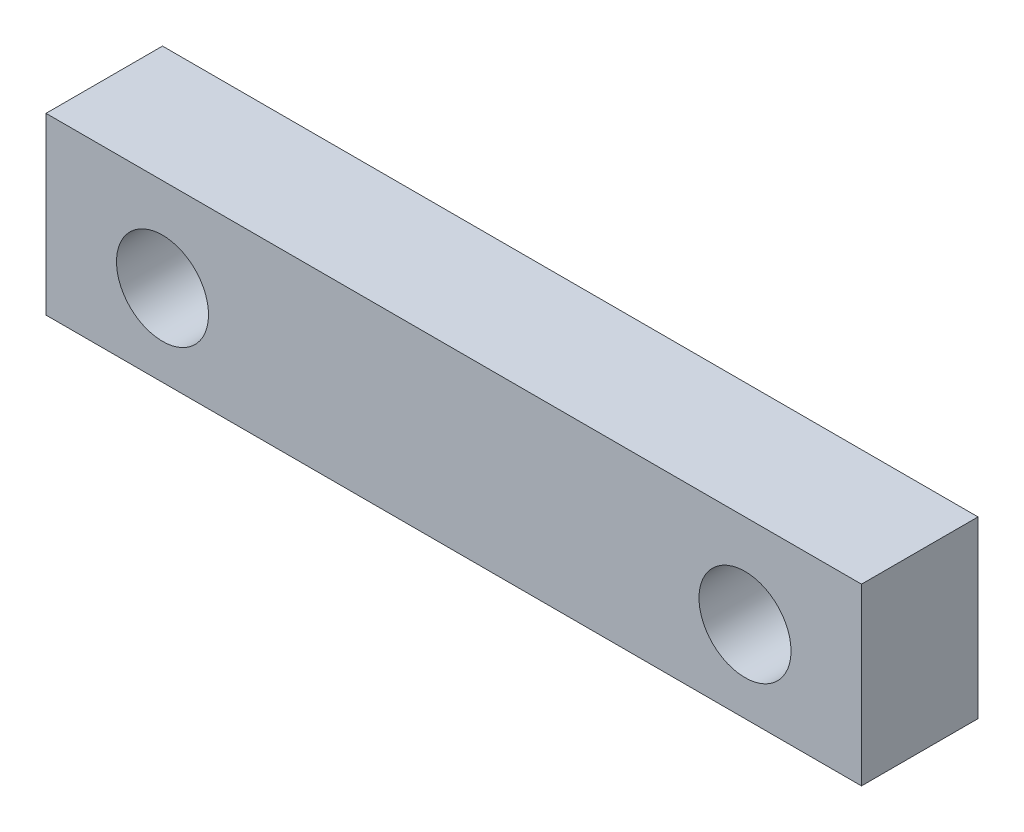
ISO-10303-21;
HEADER;
FILE_DESCRIPTION(('STEP AP214'),'2;1');
FILE_NAME('part.step','',(''),(''),'','','');
FILE_SCHEMA(('AUTOMOTIVE_DESIGN { 1 0 10303 214 1 1 1 1 }'));
ENDSEC;
DATA;
#1=APPLICATION_CONTEXT('core data for automotive mechanical design processes');
#2=APPLICATION_PROTOCOL_DEFINITION('international standard','automotive_design',2000,#1);
#3=PRODUCT_CONTEXT('',#1,'mechanical');
#4=PRODUCT('Part','Part','',(#3));
#5=PRODUCT_RELATED_PRODUCT_CATEGORY('part','',(#4));
#6=PRODUCT_DEFINITION_FORMATION('','',#4);
#7=PRODUCT_DEFINITION_CONTEXT('part definition',#1,'design');
#8=PRODUCT_DEFINITION('design','',#6,#7);
#9=PRODUCT_DEFINITION_SHAPE('','',#8);
#10=(LENGTH_UNIT() NAMED_UNIT(*) SI_UNIT(.MILLI.,.METRE.));
#11=(NAMED_UNIT(*) PLANE_ANGLE_UNIT() SI_UNIT($,.RADIAN.));
#12=(NAMED_UNIT(*) SI_UNIT($,.STERADIAN.) SOLID_ANGLE_UNIT());
#13=UNCERTAINTY_MEASURE_WITH_UNIT(LENGTH_MEASURE(1.E-05),#10,'distance_accuracy_value','');
#14=(GEOMETRIC_REPRESENTATION_CONTEXT(3) GLOBAL_UNCERTAINTY_ASSIGNED_CONTEXT((#13)) GLOBAL_UNIT_ASSIGNED_CONTEXT((#10,
#11,#12)) REPRESENTATION_CONTEXT('',''));
#15=CARTESIAN_POINT('',(0.,0.,0.));
#16=DIRECTION('',(0.,0.,1.));
#17=DIRECTION('',(1.,0.,0.));
#18=AXIS2_PLACEMENT_3D('',#15,#16,#17);
#19=CARTESIAN_POINT('',(0.,0.,6.35));
#20=DIRECTION('',(0.,0.,1.));
#21=DIRECTION('',(1.,0.,0.));
#22=AXIS2_PLACEMENT_3D('',#19,#20,#21);
#23=PLANE('',#22);
#24=CARTESIAN_POINT('',(-108.703833131341,52.9257336640657,6.35));
#25=DIRECTION('',(0.,0.,1.));
#26=DIRECTION('',(1.,0.,0.));
#27=AXIS2_PLACEMENT_3D('',#24,#25,#26);
#28=CIRCLE('',#27,2.50825000000001);
#29=CARTESIAN_POINT('',(-106.195583131341,52.9257336640657,6.35));
#30=VERTEX_POINT('',#29);
#31=EDGE_CURVE('E100',#30,#30,#28,.T.);
#32=ORIENTED_EDGE('',*,*,#31,.F.);
#33=EDGE_LOOP('',(#32));
#34=FACE_BOUND('',#33,.T.);
#35=DIRECTION('',(0.,-1.,0.));
#36=VECTOR('',#35,1.);
#37=CARTESIAN_POINT('',(-146.803833131341,58.0057336640657,6.35));
#38=LINE('',#37,#36);
#39=CARTESIAN_POINT('',(-146.803833131341,58.0057336640657,6.35));
#40=VERTEX_POINT('',#39);
#41=CARTESIAN_POINT('',(-146.803833131341,48.4807336640657,6.35));
#42=VERTEX_POINT('',#41);
#43=EDGE_CURVE('E85',#40,#42,#38,.T.);
#44=ORIENTED_EDGE('',*,*,#43,.T.);
#45=DIRECTION('',(1.,0.,0.));
#46=VECTOR('',#45,1.);
#47=CARTESIAN_POINT('',(-146.803833131341,48.4807336640657,6.35));
#48=LINE('',#47,#46);
#49=CARTESIAN_POINT('',(-102.353833131341,48.4807336640657,6.35));
#50=VERTEX_POINT('',#49);
#51=EDGE_CURVE('E80',#42,#50,#48,.T.);
#52=ORIENTED_EDGE('',*,*,#51,.T.);
#53=DIRECTION('',(0.,1.,0.));
#54=VECTOR('',#53,1.);
#55=CARTESIAN_POINT('',(-102.353833131341,48.4807336640657,6.35));
#56=LINE('',#55,#54);
#57=CARTESIAN_POINT('',(-102.353833131341,58.0057336640657,6.35));
#58=VERTEX_POINT('',#57);
#59=EDGE_CURVE('E83',#50,#58,#56,.T.);
#60=ORIENTED_EDGE('',*,*,#59,.T.);
#61=DIRECTION('',(-1.,0.,0.));
#62=VECTOR('',#61,1.);
#63=CARTESIAN_POINT('',(-102.353833131341,58.0057336640657,6.35));
#64=LINE('',#63,#62);
#65=EDGE_CURVE('E50',#58,#40,#64,.T.);
#66=ORIENTED_EDGE('',*,*,#65,.T.);
#67=EDGE_LOOP('',(#44,#52,#60,#66));
#68=FACE_BOUND('',#67,.T.);
#69=CARTESIAN_POINT('',(-140.453833131341,52.9257336640657,6.35));
#70=DIRECTION('',(0.,0.,1.));
#71=DIRECTION('',(1.,0.,0.));
#72=AXIS2_PLACEMENT_3D('',#69,#70,#71);
#73=CIRCLE('',#72,2.50824999999999);
#74=CARTESIAN_POINT('',(-137.945583131341,52.9257336640657,6.35));
#75=VERTEX_POINT('',#74);
#76=EDGE_CURVE('E115',#75,#75,#73,.T.);
#77=ORIENTED_EDGE('',*,*,#76,.F.);
#78=EDGE_LOOP('',(#77));
#79=FACE_BOUND('',#78,.T.);
#80=ADVANCED_FACE('F33',(#34,#68,#79),#23,.T.);
#81=CARTESIAN_POINT('',(0.,0.,0.));
#82=DIRECTION('',(0.,0.,1.));
#83=DIRECTION('',(1.,0.,0.));
#84=AXIS2_PLACEMENT_3D('',#81,#82,#83);
#85=PLANE('',#84);
#86=DIRECTION('',(0.,-1.,0.));
#87=VECTOR('',#86,1.);
#88=CARTESIAN_POINT('',(-146.803833131341,58.0057336640657,0.));
#89=LINE('',#88,#87);
#90=CARTESIAN_POINT('',(-146.803833131341,58.0057336640657,0.));
#91=VERTEX_POINT('',#90);
#92=CARTESIAN_POINT('',(-146.803833131341,48.4807336640657,0.));
#93=VERTEX_POINT('',#92);
#94=EDGE_CURVE('E97',#91,#93,#89,.T.);
#95=ORIENTED_EDGE('',*,*,#94,.F.);
#96=DIRECTION('',(-1.,0.,0.));
#97=VECTOR('',#96,1.);
#98=CARTESIAN_POINT('',(-102.353833131341,58.0057336640657,0.));
#99=LINE('',#98,#97);
#100=CARTESIAN_POINT('',(-102.353833131341,58.0057336640657,0.));
#101=VERTEX_POINT('',#100);
#102=EDGE_CURVE('E73',#101,#91,#99,.T.);
#103=ORIENTED_EDGE('',*,*,#102,.F.);
#104=DIRECTION('',(0.,1.,0.));
#105=VECTOR('',#104,1.);
#106=CARTESIAN_POINT('',(-102.353833131341,48.4807336640657,0.));
#107=LINE('',#106,#105);
#108=CARTESIAN_POINT('',(-102.353833131341,48.4807336640657,0.));
#109=VERTEX_POINT('',#108);
#110=EDGE_CURVE('E67',#109,#101,#107,.T.);
#111=ORIENTED_EDGE('',*,*,#110,.F.);
#112=DIRECTION('',(1.,0.,0.));
#113=VECTOR('',#112,1.);
#114=CARTESIAN_POINT('',(-146.803833131341,48.4807336640657,0.));
#115=LINE('',#114,#113);
#116=EDGE_CURVE('E89',#93,#109,#115,.T.);
#117=ORIENTED_EDGE('',*,*,#116,.F.);
#118=EDGE_LOOP('',(#95,#103,#111,#117));
#119=FACE_BOUND('',#118,.T.);
#120=CARTESIAN_POINT('',(-108.703833131341,52.9257336640657,0.));
#121=DIRECTION('',(0.,0.,1.));
#122=DIRECTION('',(1.,0.,0.));
#123=AXIS2_PLACEMENT_3D('',#120,#121,#122);
#124=CIRCLE('',#123,2.50825000000001);
#125=CARTESIAN_POINT('',(-106.195583131341,52.9257336640657,0.));
#126=VERTEX_POINT('',#125);
#127=EDGE_CURVE('E112',#126,#126,#124,.T.);
#128=ORIENTED_EDGE('',*,*,#127,.T.);
#129=EDGE_LOOP('',(#128));
#130=FACE_BOUND('',#129,.T.);
#131=CARTESIAN_POINT('',(-140.453833131341,52.9257336640657,0.));
#132=DIRECTION('',(0.,0.,1.));
#133=DIRECTION('',(1.,0.,0.));
#134=AXIS2_PLACEMENT_3D('',#131,#132,#133);
#135=CIRCLE('',#134,2.50824999999999);
#136=CARTESIAN_POINT('',(-137.945583131341,52.9257336640657,0.));
#137=VERTEX_POINT('',#136);
#138=EDGE_CURVE('E118',#137,#137,#135,.T.);
#139=ORIENTED_EDGE('',*,*,#138,.T.);
#140=EDGE_LOOP('',(#139));
#141=FACE_BOUND('',#140,.T.);
#142=ADVANCED_FACE('F108',(#119,#130,#141),#85,.F.);
#143=CARTESIAN_POINT('',(-146.803833131341,58.0057336640657,6.35));
#144=DIRECTION('',(1.,0.,0.));
#145=DIRECTION('',(0.,0.,-1.));
#146=AXIS2_PLACEMENT_3D('',#143,#144,#145);
#147=PLANE('',#146);
#148=ORIENTED_EDGE('',*,*,#94,.T.);
#149=DIRECTION('',(0.,0.,-1.));
#150=VECTOR('',#149,1.);
#151=CARTESIAN_POINT('',(-146.803833131341,48.4807336640657,6.35));
#152=LINE('',#151,#150);
#153=EDGE_CURVE('E11',#42,#93,#152,.T.);
#154=ORIENTED_EDGE('',*,*,#153,.F.);
#155=ORIENTED_EDGE('',*,*,#43,.F.);
#156=DIRECTION('',(0.,0.,-1.));
#157=VECTOR('',#156,1.);
#158=CARTESIAN_POINT('',(-146.803833131341,58.0057336640657,6.35));
#159=LINE('',#158,#157);
#160=EDGE_CURVE('E93',#40,#91,#159,.T.);
#161=ORIENTED_EDGE('',*,*,#160,.T.);
#162=EDGE_LOOP('',(#148,#154,#155,#161));
#163=FACE_BOUND('',#162,.T.);
#164=ADVANCED_FACE('F35',(#163),#147,.F.);
#165=CARTESIAN_POINT('',(-146.803833131341,48.4807336640657,6.35));
#166=DIRECTION('',(0.,1.,0.));
#167=DIRECTION('',(0.,0.,1.));
#168=AXIS2_PLACEMENT_3D('',#165,#166,#167);
#169=PLANE('',#168);
#170=ORIENTED_EDGE('',*,*,#116,.T.);
#171=DIRECTION('',(0.,0.,-1.));
#172=VECTOR('',#171,1.);
#173=CARTESIAN_POINT('',(-102.353833131341,48.4807336640657,6.35));
#174=LINE('',#173,#172);
#175=EDGE_CURVE('E42',#50,#109,#174,.T.);
#176=ORIENTED_EDGE('',*,*,#175,.F.);
#177=ORIENTED_EDGE('',*,*,#51,.F.);
#178=ORIENTED_EDGE('',*,*,#153,.T.);
#179=EDGE_LOOP('',(#170,#176,#177,#178));
#180=FACE_BOUND('',#179,.T.);
#181=ADVANCED_FACE('F88',(#180),#169,.F.);
#182=CARTESIAN_POINT('',(-102.353833131341,48.4807336640657,6.35));
#183=DIRECTION('',(-1.,0.,0.));
#184=DIRECTION('',(0.,0.,1.));
#185=AXIS2_PLACEMENT_3D('',#182,#183,#184);
#186=PLANE('',#185);
#187=ORIENTED_EDGE('',*,*,#110,.T.);
#188=DIRECTION('',(0.,0.,-1.));
#189=VECTOR('',#188,1.);
#190=CARTESIAN_POINT('',(-102.353833131341,58.0057336640657,6.35));
#191=LINE('',#190,#189);
#192=EDGE_CURVE('E90',#58,#101,#191,.T.);
#193=ORIENTED_EDGE('',*,*,#192,.F.);
#194=ORIENTED_EDGE('',*,*,#59,.F.);
#195=ORIENTED_EDGE('',*,*,#175,.T.);
#196=EDGE_LOOP('',(#187,#193,#194,#195));
#197=FACE_BOUND('',#196,.T.);
#198=ADVANCED_FACE('F91',(#197),#186,.F.);
#199=CARTESIAN_POINT('',(-102.353833131341,58.0057336640657,6.35));
#200=DIRECTION('',(0.,-1.,0.));
#201=DIRECTION('',(0.,0.,-1.));
#202=AXIS2_PLACEMENT_3D('',#199,#200,#201);
#203=PLANE('',#202);
#204=ORIENTED_EDGE('',*,*,#102,.T.);
#205=ORIENTED_EDGE('',*,*,#160,.F.);
#206=ORIENTED_EDGE('',*,*,#65,.F.);
#207=ORIENTED_EDGE('',*,*,#192,.T.);
#208=EDGE_LOOP('',(#204,#205,#206,#207));
#209=FACE_BOUND('',#208,.T.);
#210=ADVANCED_FACE('F105',(#209),#203,.F.);
#211=CARTESIAN_POINT('',(-108.703833131341,52.9257336640657,6.35));
#212=DIRECTION('',(0.,0.,-1.));
#213=DIRECTION('',(-1.,0.,0.));
#214=AXIS2_PLACEMENT_3D('',#211,#212,#213);
#215=CYLINDRICAL_SURFACE('',#214,2.50825000000001);
#216=ORIENTED_EDGE('',*,*,#31,.T.);
#217=EDGE_LOOP('',(#216));
#218=FACE_BOUND('',#217,.T.);
#219=ORIENTED_EDGE('',*,*,#127,.F.);
#220=EDGE_LOOP('',(#219));
#221=FACE_BOUND('',#220,.T.);
#222=ADVANCED_FACE('F135',(#218,#221),#215,.F.);
#223=CARTESIAN_POINT('',(-140.453833131341,52.9257336640657,6.35));
#224=DIRECTION('',(0.,0.,-1.));
#225=DIRECTION('',(-1.,0.,0.));
#226=AXIS2_PLACEMENT_3D('',#223,#224,#225);
#227=CYLINDRICAL_SURFACE('',#226,2.50824999999999);
#228=ORIENTED_EDGE('',*,*,#76,.T.);
#229=EDGE_LOOP('',(#228));
#230=FACE_BOUND('',#229,.T.);
#231=ORIENTED_EDGE('',*,*,#138,.F.);
#232=EDGE_LOOP('',(#231));
#233=FACE_BOUND('',#232,.T.);
#234=ADVANCED_FACE('F124',(#230,#233),#227,.F.);
#235=CLOSED_SHELL('',(#80,#142,#164,#181,#198,#210,#222,#234));
#236=MANIFOLD_SOLID_BREP('B2',#235);
#237=ADVANCED_BREP_SHAPE_REPRESENTATION('',(#18,#236),#14);
#238=SHAPE_DEFINITION_REPRESENTATION(#9,#237);
ENDSEC;
END-ISO-10303-21;
